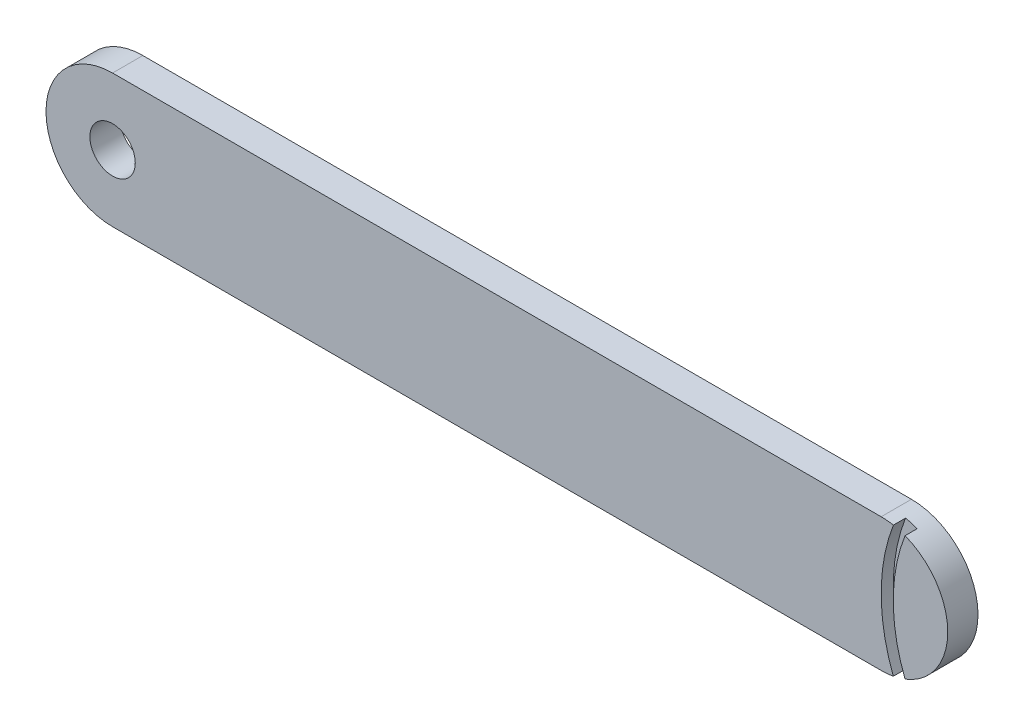
ISO-10303-21;
HEADER;
FILE_DESCRIPTION(('STEP AP214'),'2;1');
FILE_NAME('part.step','',(''),(''),'','','');
FILE_SCHEMA(('AUTOMOTIVE_DESIGN { 1 0 10303 214 1 1 1 1 }'));
ENDSEC;
DATA;
#1=APPLICATION_CONTEXT('core data for automotive mechanical design processes');
#2=APPLICATION_PROTOCOL_DEFINITION('international standard','automotive_design',2000,#1);
#3=PRODUCT_CONTEXT('',#1,'mechanical');
#4=PRODUCT('Part','Part','',(#3));
#5=PRODUCT_RELATED_PRODUCT_CATEGORY('part','',(#4));
#6=PRODUCT_DEFINITION_FORMATION('','',#4);
#7=PRODUCT_DEFINITION_CONTEXT('part definition',#1,'design');
#8=PRODUCT_DEFINITION('design','',#6,#7);
#9=PRODUCT_DEFINITION_SHAPE('','',#8);
#10=(LENGTH_UNIT() NAMED_UNIT(*) SI_UNIT(.MILLI.,.METRE.));
#11=(NAMED_UNIT(*) PLANE_ANGLE_UNIT() SI_UNIT($,.RADIAN.));
#12=(NAMED_UNIT(*) SI_UNIT($,.STERADIAN.) SOLID_ANGLE_UNIT());
#13=UNCERTAINTY_MEASURE_WITH_UNIT(LENGTH_MEASURE(1.E-05),#10,'distance_accuracy_value','');
#14=(GEOMETRIC_REPRESENTATION_CONTEXT(3) GLOBAL_UNCERTAINTY_ASSIGNED_CONTEXT((#13)) GLOBAL_UNIT_ASSIGNED_CONTEXT((#10,
#11,#12)) REPRESENTATION_CONTEXT('',''));
#15=CARTESIAN_POINT('',(0.,0.,0.));
#16=DIRECTION('',(0.,0.,1.));
#17=DIRECTION('',(1.,0.,0.));
#18=AXIS2_PLACEMENT_3D('',#15,#16,#17);
#19=CARTESIAN_POINT('',(0.,0.,5.));
#20=DIRECTION('',(0.,0.,1.));
#21=DIRECTION('',(1.,0.,0.));
#22=AXIS2_PLACEMENT_3D('',#19,#20,#21);
#23=PLANE('',#22);
#24=CARTESIAN_POINT('',(157.,11.,5.));
#25=DIRECTION('',(0.,0.,-1.));
#26=DIRECTION('',(1.,0.,0.));
#27=AXIS2_PLACEMENT_3D('',#24,#25,#26);
#28=CIRCLE('',#27,28.);
#29=CARTESIAN_POINT('',(130.95,0.733671542367274,5.));
#30=VERTEX_POINT('',#29);
#31=CARTESIAN_POINT('',(130.95,21.2663284576327,5.));
#32=VERTEX_POINT('',#31);
#33=EDGE_CURVE('E162',#30,#32,#28,.T.);
#34=ORIENTED_EDGE('',*,*,#33,.F.);
#35=CARTESIAN_POINT('',(127.,11.,5.));
#36=DIRECTION('',(0.,0.,1.));
#37=DIRECTION('',(1.,0.,0.));
#38=AXIS2_PLACEMENT_3D('',#35,#36,#37);
#39=CIRCLE('',#38,11.);
#40=EDGE_CURVE('E198',#30,#32,#39,.T.);
#41=ORIENTED_EDGE('',*,*,#40,.T.);
#42=EDGE_LOOP('',(#34,#41));
#43=FACE_BOUND('',#42,.T.);
#44=ADVANCED_FACE('F34',(#43),#23,.T.);
#45=CARTESIAN_POINT('',(0.,22.,5.));
#46=DIRECTION('',(0.,-1.,0.));
#47=DIRECTION('',(1.,0.,0.));
#48=AXIS2_PLACEMENT_3D('',#45,#46,#47);
#49=PLANE('',#48);
#50=DIRECTION('',(-1.,0.,0.));
#51=VECTOR('',#50,1.);
#52=CARTESIAN_POINT('',(0.,22.,0.));
#53=LINE('',#52,#51);
#54=CARTESIAN_POINT('',(127.,22.,0.));
#55=VERTEX_POINT('',#54);
#56=CARTESIAN_POINT('',(0.,22.,0.));
#57=VERTEX_POINT('',#56);
#58=EDGE_CURVE('E201',#55,#57,#53,.T.);
#59=ORIENTED_EDGE('',*,*,#58,.T.);
#60=DIRECTION('',(0.,0.,-1.));
#61=VECTOR('',#60,1.);
#62=CARTESIAN_POINT('',(0.,22.,5.));
#63=LINE('',#62,#61);
#64=CARTESIAN_POINT('',(0.,22.,5.));
#65=VERTEX_POINT('',#64);
#66=EDGE_CURVE('E11',#65,#57,#63,.T.);
#67=ORIENTED_EDGE('',*,*,#66,.F.);
#68=DIRECTION('',(-1.,0.,0.));
#69=VECTOR('',#68,1.);
#70=CARTESIAN_POINT('',(0.,22.,5.));
#71=LINE('',#70,#69);
#72=CARTESIAN_POINT('',(127.,22.,5.));
#73=VERTEX_POINT('',#72);
#74=EDGE_CURVE('E185',#73,#65,#71,.T.);
#75=ORIENTED_EDGE('',*,*,#74,.F.);
#76=DIRECTION('',(0.,0.,-1.));
#77=VECTOR('',#76,1.);
#78=CARTESIAN_POINT('',(127.,22.,5.));
#79=LINE('',#78,#77);
#80=EDGE_CURVE('E197',#73,#55,#79,.T.);
#81=ORIENTED_EDGE('',*,*,#80,.T.);
#82=EDGE_LOOP('',(#59,#67,#75,#81));
#83=FACE_BOUND('',#82,.T.);
#84=ADVANCED_FACE('F233',(#83),#49,.F.);
#85=CARTESIAN_POINT('',(0.,11.,5.));
#86=DIRECTION('',(0.,0.,-1.));
#87=DIRECTION('',(-1.,0.,0.));
#88=AXIS2_PLACEMENT_3D('',#85,#86,#87);
#89=CYLINDRICAL_SURFACE('',#88,11.);
#90=CARTESIAN_POINT('',(0.,11.,0.));
#91=DIRECTION('',(0.,0.,1.));
#92=DIRECTION('',(1.,0.,0.));
#93=AXIS2_PLACEMENT_3D('',#90,#91,#92);
#94=CIRCLE('',#93,11.);
#95=CARTESIAN_POINT('',(0.,0.,0.));
#96=VERTEX_POINT('',#95);
#97=EDGE_CURVE('E204',#57,#96,#94,.T.);
#98=ORIENTED_EDGE('',*,*,#97,.T.);
#99=DIRECTION('',(0.,0.,-1.));
#100=VECTOR('',#99,1.);
#101=CARTESIAN_POINT('',(0.,0.,5.));
#102=LINE('',#101,#100);
#103=CARTESIAN_POINT('',(0.,0.,5.));
#104=VERTEX_POINT('',#103);
#105=EDGE_CURVE('E42',#104,#96,#102,.T.);
#106=ORIENTED_EDGE('',*,*,#105,.F.);
#107=CARTESIAN_POINT('',(0.,11.,5.));
#108=DIRECTION('',(0.,0.,1.));
#109=DIRECTION('',(1.,0.,0.));
#110=AXIS2_PLACEMENT_3D('',#107,#108,#109);
#111=CIRCLE('',#110,11.);
#112=EDGE_CURVE('E189',#65,#104,#111,.T.);
#113=ORIENTED_EDGE('',*,*,#112,.F.);
#114=ORIENTED_EDGE('',*,*,#66,.T.);
#115=EDGE_LOOP('',(#98,#106,#113,#114));
#116=FACE_BOUND('',#115,.T.);
#117=ADVANCED_FACE('F263',(#116),#89,.T.);
#118=CARTESIAN_POINT('',(0.,0.,5.));
#119=DIRECTION('',(0.,1.,0.));
#120=DIRECTION('',(0.,0.,1.));
#121=AXIS2_PLACEMENT_3D('',#118,#119,#120);
#122=PLANE('',#121);
#123=DIRECTION('',(1.,0.,0.));
#124=VECTOR('',#123,1.);
#125=CARTESIAN_POINT('',(0.,0.,0.));
#126=LINE('',#125,#124);
#127=CARTESIAN_POINT('',(127.,0.,0.));
#128=VERTEX_POINT('',#127);
#129=EDGE_CURVE('E206',#96,#128,#126,.T.);
#130=ORIENTED_EDGE('',*,*,#129,.T.);
#131=DIRECTION('',(0.,0.,-1.));
#132=VECTOR('',#131,1.);
#133=CARTESIAN_POINT('',(127.,0.,5.));
#134=LINE('',#133,#132);
#135=CARTESIAN_POINT('',(127.,0.,5.));
#136=VERTEX_POINT('',#135);
#137=EDGE_CURVE('E211',#136,#128,#134,.T.);
#138=ORIENTED_EDGE('',*,*,#137,.F.);
#139=DIRECTION('',(1.,0.,0.));
#140=VECTOR('',#139,1.);
#141=CARTESIAN_POINT('',(0.,0.,5.));
#142=LINE('',#141,#140);
#143=EDGE_CURVE('E191',#104,#136,#142,.T.);
#144=ORIENTED_EDGE('',*,*,#143,.F.);
#145=ORIENTED_EDGE('',*,*,#105,.T.);
#146=EDGE_LOOP('',(#130,#138,#144,#145));
#147=FACE_BOUND('',#146,.T.);
#148=ADVANCED_FACE('F218',(#147),#122,.F.);
#149=CARTESIAN_POINT('',(0.,11.,5.));
#150=DIRECTION('',(0.,0.,-1.));
#151=DIRECTION('',(-1.,0.,0.));
#152=AXIS2_PLACEMENT_3D('',#149,#150,#151);
#153=CYLINDRICAL_SURFACE('',#152,3.75);
#154=DIRECTION('',(0.,0.,-1.));
#155=VECTOR('',#154,1.);
#156=CARTESIAN_POINT('',(0.,14.75,1.5));
#157=LINE('',#156,#155);
#158=CARTESIAN_POINT('',(0.,14.75,1.5));
#159=VERTEX_POINT('',#158);
#160=CARTESIAN_POINT('',(0.,14.75,0.));
#161=VERTEX_POINT('',#160);
#162=EDGE_CURVE('E155',#159,#161,#157,.T.);
#163=ORIENTED_EDGE('',*,*,#162,.F.);
#164=CARTESIAN_POINT('',(0.,11.,1.5));
#165=DIRECTION('',(0.,0.,1.));
#166=DIRECTION('',(-1.,0.,0.));
#167=AXIS2_PLACEMENT_3D('',#164,#165,#166);
#168=CIRCLE('',#167,3.75);
#169=CARTESIAN_POINT('',(0.,7.24999999999999,1.5));
#170=VERTEX_POINT('',#169);
#171=EDGE_CURVE('E138',#170,#159,#168,.T.);
#172=ORIENTED_EDGE('',*,*,#171,.F.);
#173=DIRECTION('',(0.,0.,-1.));
#174=VECTOR('',#173,1.);
#175=CARTESIAN_POINT('',(0.,7.24999999999999,1.5));
#176=LINE('',#175,#174);
#177=CARTESIAN_POINT('',(0.,7.24999999999999,0.));
#178=VERTEX_POINT('',#177);
#179=EDGE_CURVE('E129',#170,#178,#176,.T.);
#180=ORIENTED_EDGE('',*,*,#179,.T.);
#181=CARTESIAN_POINT('',(0.,11.,0.));
#182=DIRECTION('',(0.,0.,1.));
#183=DIRECTION('',(1.,0.,0.));
#184=AXIS2_PLACEMENT_3D('',#181,#182,#183);
#185=CIRCLE('',#184,3.75);
#186=EDGE_CURVE('E175',#161,#178,#185,.T.);
#187=ORIENTED_EDGE('',*,*,#186,.F.);
#188=EDGE_LOOP('',(#163,#172,#180,#187));
#189=FACE_BOUND('',#188,.T.);
#190=CARTESIAN_POINT('',(0.,11.,5.));
#191=DIRECTION('',(0.,0.,1.));
#192=DIRECTION('',(1.,0.,0.));
#193=AXIS2_PLACEMENT_3D('',#190,#191,#192);
#194=CIRCLE('',#193,3.75);
#195=CARTESIAN_POINT('',(3.75,11.,5.));
#196=VERTEX_POINT('',#195);
#197=EDGE_CURVE('E182',#196,#196,#194,.T.);
#198=ORIENTED_EDGE('',*,*,#197,.T.);
#199=EDGE_LOOP('',(#198));
#200=FACE_BOUND('',#199,.T.);
#201=ADVANCED_FACE('F36',(#189,#200),#153,.F.);
#202=CARTESIAN_POINT('',(127.,11.,5.));
#203=DIRECTION('',(0.,0.,-1.));
#204=DIRECTION('',(-1.,0.,0.));
#205=AXIS2_PLACEMENT_3D('',#202,#203,#204);
#206=CYLINDRICAL_SURFACE('',#205,11.);
#207=CARTESIAN_POINT('',(127.,11.,3.));
#208=DIRECTION('',(0.,0.,1.));
#209=DIRECTION('',(1.,0.,0.));
#210=AXIS2_PLACEMENT_3D('',#207,#208,#209);
#211=CIRCLE('',#210,11.);
#212=CARTESIAN_POINT('',(130.95,21.2663284576327,3.));
#213=VERTEX_POINT('',#212);
#214=CARTESIAN_POINT('',(129.016666666667,21.8135588755763,3.));
#215=VERTEX_POINT('',#214);
#216=EDGE_CURVE('E158',#213,#215,#211,.T.);
#217=ORIENTED_EDGE('',*,*,#216,.F.);
#218=DIRECTION('',(0.,0.,1.));
#219=VECTOR('',#218,1.);
#220=CARTESIAN_POINT('',(130.95,21.2663284576327,3.));
#221=LINE('',#220,#219);
#222=EDGE_CURVE('E172',#213,#32,#221,.T.);
#223=ORIENTED_EDGE('',*,*,#222,.T.);
#224=ORIENTED_EDGE('',*,*,#40,.F.);
#225=DIRECTION('',(0.,0.,1.));
#226=VECTOR('',#225,1.);
#227=CARTESIAN_POINT('',(130.95,0.733671542367274,3.));
#228=LINE('',#227,#226);
#229=CARTESIAN_POINT('',(130.95,0.733671542367274,3.));
#230=VERTEX_POINT('',#229);
#231=EDGE_CURVE('E176',#230,#30,#228,.T.);
#232=ORIENTED_EDGE('',*,*,#231,.F.);
#233=CARTESIAN_POINT('',(127.,11.,3.));
#234=DIRECTION('',(0.,0.,1.));
#235=DIRECTION('',(1.,0.,0.));
#236=AXIS2_PLACEMENT_3D('',#233,#234,#235);
#237=CIRCLE('',#236,11.);
#238=CARTESIAN_POINT('',(129.016666666667,0.186441124423696,3.));
#239=VERTEX_POINT('',#238);
#240=EDGE_CURVE('E165',#239,#230,#237,.T.);
#241=ORIENTED_EDGE('',*,*,#240,.F.);
#242=DIRECTION('',(0.,0.,1.));
#243=VECTOR('',#242,1.);
#244=CARTESIAN_POINT('',(129.016666666667,0.186441124423696,3.));
#245=LINE('',#244,#243);
#246=CARTESIAN_POINT('',(129.016666666667,0.186441124423696,5.));
#247=VERTEX_POINT('',#246);
#248=EDGE_CURVE('E178',#239,#247,#245,.T.);
#249=ORIENTED_EDGE('',*,*,#248,.T.);
#250=EDGE_CURVE('E194',#136,#247,#39,.T.);
#251=ORIENTED_EDGE('',*,*,#250,.F.);
#252=ORIENTED_EDGE('',*,*,#137,.T.);
#253=CARTESIAN_POINT('',(127.,11.,0.));
#254=DIRECTION('',(0.,0.,1.));
#255=DIRECTION('',(1.,0.,0.));
#256=AXIS2_PLACEMENT_3D('',#253,#254,#255);
#257=CIRCLE('',#256,11.);
#258=EDGE_CURVE('E186',#128,#55,#257,.T.);
#259=ORIENTED_EDGE('',*,*,#258,.T.);
#260=ORIENTED_EDGE('',*,*,#80,.F.);
#261=CARTESIAN_POINT('',(129.016666666667,21.8135588755763,5.));
#262=VERTEX_POINT('',#261);
#263=EDGE_CURVE('E193',#262,#73,#39,.T.);
#264=ORIENTED_EDGE('',*,*,#263,.F.);
#265=DIRECTION('',(0.,0.,1.));
#266=VECTOR('',#265,1.);
#267=CARTESIAN_POINT('',(129.016666666667,21.8135588755763,3.));
#268=LINE('',#267,#266);
#269=EDGE_CURVE('E57',#215,#262,#268,.T.);
#270=ORIENTED_EDGE('',*,*,#269,.F.);
#271=EDGE_LOOP('',(#217,#223,#224,#232,#241,#249,#251,#252,#259,#260,#264,#270));
#272=FACE_BOUND('',#271,.T.);
#273=ADVANCED_FACE('F228',(#272),#206,.T.);
#274=CARTESIAN_POINT('',(157.,11.,5.));
#275=DIRECTION('',(0.,0.,1.));
#276=DIRECTION('',(1.,0.,0.));
#277=AXIS2_PLACEMENT_3D('',#274,#275,#276);
#278=CIRCLE('',#277,30.);
#279=EDGE_CURVE('E154',#262,#247,#278,.T.);
#280=ORIENTED_EDGE('',*,*,#279,.F.);
#281=ORIENTED_EDGE('',*,*,#263,.T.);
#282=ORIENTED_EDGE('',*,*,#74,.T.);
#283=ORIENTED_EDGE('',*,*,#112,.T.);
#284=ORIENTED_EDGE('',*,*,#143,.T.);
#285=ORIENTED_EDGE('',*,*,#250,.T.);
#286=EDGE_LOOP('',(#280,#281,#282,#283,#284,#285));
#287=FACE_BOUND('',#286,.T.);
#288=ORIENTED_EDGE('',*,*,#197,.F.);
#289=EDGE_LOOP('',(#288));
#290=FACE_BOUND('',#289,.T.);
#291=ADVANCED_FACE('F236',(#287,#290),#23,.T.);
#292=CARTESIAN_POINT('',(0.,0.,0.));
#293=DIRECTION('',(0.,0.,1.));
#294=DIRECTION('',(1.,0.,0.));
#295=AXIS2_PLACEMENT_3D('',#292,#293,#294);
#296=PLANE('',#295);
#297=CARTESIAN_POINT('',(18.25,11.,0.));
#298=DIRECTION('',(0.,0.,-1.));
#299=DIRECTION('',(1.,0.,0.));
#300=AXIS2_PLACEMENT_3D('',#297,#298,#299);
#301=CIRCLE('',#300,3.75);
#302=CARTESIAN_POINT('',(18.25,14.75,0.));
#303=VERTEX_POINT('',#302);
#304=CARTESIAN_POINT('',(18.25,7.24999999999999,0.));
#305=VERTEX_POINT('',#304);
#306=EDGE_CURVE('E49',#303,#305,#301,.T.);
#307=ORIENTED_EDGE('',*,*,#306,.F.);
#308=DIRECTION('',(1.,0.,0.));
#309=VECTOR('',#308,1.);
#310=CARTESIAN_POINT('',(0.,14.75,0.));
#311=LINE('',#310,#309);
#312=EDGE_CURVE('E142',#161,#303,#311,.T.);
#313=ORIENTED_EDGE('',*,*,#312,.F.);
#314=ORIENTED_EDGE('',*,*,#186,.T.);
#315=DIRECTION('',(-1.,0.,0.));
#316=VECTOR('',#315,1.);
#317=CARTESIAN_POINT('',(0.,7.24999999999999,0.));
#318=LINE('',#317,#316);
#319=EDGE_CURVE('E145',#305,#178,#318,.T.);
#320=ORIENTED_EDGE('',*,*,#319,.F.);
#321=EDGE_LOOP('',(#307,#313,#314,#320));
#322=FACE_BOUND('',#321,.T.);
#323=ORIENTED_EDGE('',*,*,#58,.F.);
#324=ORIENTED_EDGE('',*,*,#258,.F.);
#325=ORIENTED_EDGE('',*,*,#129,.F.);
#326=ORIENTED_EDGE('',*,*,#97,.F.);
#327=EDGE_LOOP('',(#323,#324,#325,#326));
#328=FACE_BOUND('',#327,.T.);
#329=ADVANCED_FACE('F224',(#322,#328),#296,.F.);
#330=CARTESIAN_POINT('',(157.,11.,3.));
#331=DIRECTION('',(0.,0.,1.));
#332=DIRECTION('',(1.,0.,0.));
#333=AXIS2_PLACEMENT_3D('',#330,#331,#332);
#334=CYLINDRICAL_SURFACE('',#333,28.);
#335=ORIENTED_EDGE('',*,*,#33,.T.);
#336=ORIENTED_EDGE('',*,*,#222,.F.);
#337=CARTESIAN_POINT('',(157.,11.,3.));
#338=DIRECTION('',(0.,0.,-1.));
#339=DIRECTION('',(1.,0.,0.));
#340=AXIS2_PLACEMENT_3D('',#337,#338,#339);
#341=CIRCLE('',#340,28.);
#342=EDGE_CURVE('E167',#230,#213,#341,.T.);
#343=ORIENTED_EDGE('',*,*,#342,.F.);
#344=ORIENTED_EDGE('',*,*,#231,.T.);
#345=EDGE_LOOP('',(#335,#336,#343,#344));
#346=FACE_BOUND('',#345,.T.);
#347=ADVANCED_FACE('F246',(#346),#334,.T.);
#348=CARTESIAN_POINT('',(157.,11.,3.));
#349=DIRECTION('',(0.,0.,1.));
#350=DIRECTION('',(1.,0.,0.));
#351=AXIS2_PLACEMENT_3D('',#348,#349,#350);
#352=CYLINDRICAL_SURFACE('',#351,30.);
#353=ORIENTED_EDGE('',*,*,#279,.T.);
#354=ORIENTED_EDGE('',*,*,#248,.F.);
#355=CARTESIAN_POINT('',(157.,11.,3.));
#356=DIRECTION('',(0.,0.,1.));
#357=DIRECTION('',(1.,0.,0.));
#358=AXIS2_PLACEMENT_3D('',#355,#356,#357);
#359=CIRCLE('',#358,30.);
#360=EDGE_CURVE('E161',#215,#239,#359,.T.);
#361=ORIENTED_EDGE('',*,*,#360,.F.);
#362=ORIENTED_EDGE('',*,*,#269,.T.);
#363=EDGE_LOOP('',(#353,#354,#361,#362));
#364=FACE_BOUND('',#363,.T.);
#365=ADVANCED_FACE('F249',(#364),#352,.F.);
#366=CARTESIAN_POINT('',(142.,11.,3.));
#367=DIRECTION('',(0.,0.,1.));
#368=DIRECTION('',(1.,0.,0.));
#369=AXIS2_PLACEMENT_3D('',#366,#367,#368);
#370=PLANE('',#369);
#371=ORIENTED_EDGE('',*,*,#216,.T.);
#372=ORIENTED_EDGE('',*,*,#360,.T.);
#373=ORIENTED_EDGE('',*,*,#240,.T.);
#374=ORIENTED_EDGE('',*,*,#342,.T.);
#375=EDGE_LOOP('',(#371,#372,#373,#374));
#376=FACE_BOUND('',#375,.T.);
#377=ADVANCED_FACE('F248',(#376),#370,.T.);
#378=CARTESIAN_POINT('',(18.25,11.,1.5));
#379=DIRECTION('',(0.,0.,-1.));
#380=DIRECTION('',(-1.,0.,0.));
#381=AXIS2_PLACEMENT_3D('',#378,#379,#380);
#382=CYLINDRICAL_SURFACE('',#381,3.75);
#383=ORIENTED_EDGE('',*,*,#306,.T.);
#384=DIRECTION('',(0.,0.,-1.));
#385=VECTOR('',#384,1.);
#386=CARTESIAN_POINT('',(18.25,7.24999999999999,1.5));
#387=LINE('',#386,#385);
#388=CARTESIAN_POINT('',(18.25,7.24999999999999,1.5));
#389=VERTEX_POINT('',#388);
#390=EDGE_CURVE('E121',#389,#305,#387,.T.);
#391=ORIENTED_EDGE('',*,*,#390,.F.);
#392=CARTESIAN_POINT('',(18.25,11.,1.5));
#393=DIRECTION('',(0.,0.,-1.));
#394=DIRECTION('',(1.,0.,0.));
#395=AXIS2_PLACEMENT_3D('',#392,#393,#394);
#396=CIRCLE('',#395,3.75);
#397=CARTESIAN_POINT('',(18.25,14.75,1.5));
#398=VERTEX_POINT('',#397);
#399=EDGE_CURVE('E125',#398,#389,#396,.T.);
#400=ORIENTED_EDGE('',*,*,#399,.F.);
#401=DIRECTION('',(0.,0.,-1.));
#402=VECTOR('',#401,1.);
#403=CARTESIAN_POINT('',(18.25,14.75,1.5));
#404=LINE('',#403,#402);
#405=EDGE_CURVE('E152',#398,#303,#404,.T.);
#406=ORIENTED_EDGE('',*,*,#405,.T.);
#407=EDGE_LOOP('',(#383,#391,#400,#406));
#408=FACE_BOUND('',#407,.T.);
#409=ADVANCED_FACE('F123',(#408),#382,.F.);
#410=CARTESIAN_POINT('',(0.,14.75,1.5));
#411=DIRECTION('',(0.,1.,0.));
#412=DIRECTION('',(-1.,0.,0.));
#413=AXIS2_PLACEMENT_3D('',#410,#411,#412);
#414=PLANE('',#413);
#415=ORIENTED_EDGE('',*,*,#312,.T.);
#416=ORIENTED_EDGE('',*,*,#405,.F.);
#417=DIRECTION('',(1.,0.,0.));
#418=VECTOR('',#417,1.);
#419=CARTESIAN_POINT('',(0.,14.75,1.5));
#420=LINE('',#419,#418);
#421=EDGE_CURVE('E130',#159,#398,#420,.T.);
#422=ORIENTED_EDGE('',*,*,#421,.F.);
#423=ORIENTED_EDGE('',*,*,#162,.T.);
#424=EDGE_LOOP('',(#415,#416,#422,#423));
#425=FACE_BOUND('',#424,.T.);
#426=ADVANCED_FACE('F313',(#425),#414,.F.);
#427=CARTESIAN_POINT('',(0.,7.24999999999999,1.5));
#428=DIRECTION('',(0.,-1.,0.));
#429=DIRECTION('',(1.,0.,0.));
#430=AXIS2_PLACEMENT_3D('',#427,#428,#429);
#431=PLANE('',#430);
#432=ORIENTED_EDGE('',*,*,#319,.T.);
#433=ORIENTED_EDGE('',*,*,#179,.F.);
#434=DIRECTION('',(-1.,0.,0.));
#435=VECTOR('',#434,1.);
#436=CARTESIAN_POINT('',(0.,7.24999999999999,1.5));
#437=LINE('',#436,#435);
#438=EDGE_CURVE('E133',#389,#170,#437,.T.);
#439=ORIENTED_EDGE('',*,*,#438,.F.);
#440=ORIENTED_EDGE('',*,*,#390,.T.);
#441=EDGE_LOOP('',(#432,#433,#439,#440));
#442=FACE_BOUND('',#441,.T.);
#443=ADVANCED_FACE('F134',(#442),#431,.F.);
#444=CARTESIAN_POINT('',(18.25,11.,1.5));
#445=DIRECTION('',(0.,0.,1.));
#446=DIRECTION('',(1.,0.,0.));
#447=AXIS2_PLACEMENT_3D('',#444,#445,#446);
#448=PLANE('',#447);
#449=ORIENTED_EDGE('',*,*,#399,.T.);
#450=ORIENTED_EDGE('',*,*,#438,.T.);
#451=ORIENTED_EDGE('',*,*,#171,.T.);
#452=ORIENTED_EDGE('',*,*,#421,.T.);
#453=EDGE_LOOP('',(#449,#450,#451,#452));
#454=FACE_BOUND('',#453,.T.);
#455=ADVANCED_FACE('F140',(#454),#448,.F.);
#456=CLOSED_SHELL('',(#44,#84,#117,#148,#201,#273,#291,#329,#347,#365,#377,#409,#426,#443,#455));
#457=MANIFOLD_SOLID_BREP('B2',#456);
#458=ADVANCED_BREP_SHAPE_REPRESENTATION('',(#18,#457),#14);
#459=SHAPE_DEFINITION_REPRESENTATION(#9,#458);
ENDSEC;
END-ISO-10303-21;
